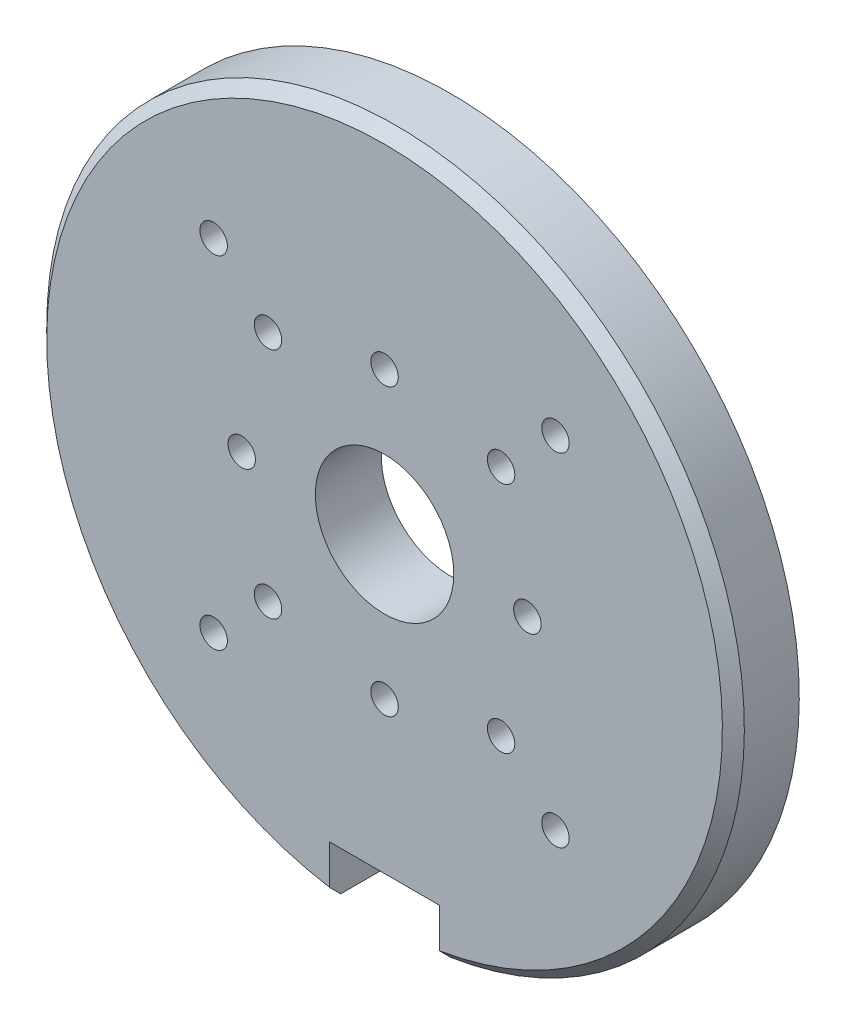
ISO-10303-21;
HEADER;
FILE_DESCRIPTION(('STEP AP214'),'2;1');
FILE_NAME('part.step','',(''),(''),'','','');
FILE_SCHEMA(('AUTOMOTIVE_DESIGN { 1 0 10303 214 1 1 1 1 }'));
ENDSEC;
DATA;
#1=APPLICATION_CONTEXT('core data for automotive mechanical design processes');
#2=APPLICATION_PROTOCOL_DEFINITION('international standard','automotive_design',2000,#1);
#3=PRODUCT_CONTEXT('',#1,'mechanical');
#4=PRODUCT('Part','Part','',(#3));
#5=PRODUCT_RELATED_PRODUCT_CATEGORY('part','',(#4));
#6=PRODUCT_DEFINITION_FORMATION('','',#4);
#7=PRODUCT_DEFINITION_CONTEXT('part definition',#1,'design');
#8=PRODUCT_DEFINITION('design','',#6,#7);
#9=PRODUCT_DEFINITION_SHAPE('','',#8);
#10=(LENGTH_UNIT() NAMED_UNIT(*) SI_UNIT(.MILLI.,.METRE.));
#11=(NAMED_UNIT(*) PLANE_ANGLE_UNIT() SI_UNIT($,.RADIAN.));
#12=(NAMED_UNIT(*) SI_UNIT($,.STERADIAN.) SOLID_ANGLE_UNIT());
#13=UNCERTAINTY_MEASURE_WITH_UNIT(LENGTH_MEASURE(1.E-05),#10,'distance_accuracy_value','');
#14=(GEOMETRIC_REPRESENTATION_CONTEXT(3) GLOBAL_UNCERTAINTY_ASSIGNED_CONTEXT((#13)) GLOBAL_UNIT_ASSIGNED_CONTEXT((#10,
#11,#12)) REPRESENTATION_CONTEXT('',''));
#15=CARTESIAN_POINT('',(0.,0.,0.));
#16=DIRECTION('',(0.,0.,1.));
#17=DIRECTION('',(1.,0.,0.));
#18=AXIS2_PLACEMENT_3D('',#15,#16,#17);
#19=CARTESIAN_POINT('',(0.,0.,6.));
#20=DIRECTION('',(0.,0.,-1.));
#21=DIRECTION('',(-1.,0.,0.));
#22=AXIS2_PLACEMENT_3D('',#19,#20,#21);
#23=CYLINDRICAL_SURFACE('',#22,31.75);
#24=DIRECTION('',(0.,0.,-1.));
#25=VECTOR('',#24,1.);
#26=CARTESIAN_POINT('',(-5.,-31.3538275175456,6.));
#27=LINE('',#26,#25);
#28=CARTESIAN_POINT('',(-5.,-31.3538275175456,0.));
#29=VERTEX_POINT('',#28);
#30=CARTESIAN_POINT('',(-5.,-31.3538275175456,5.00000000000001));
#31=VERTEX_POINT('',#30);
#32=EDGE_CURVE('E146',#29,#31,#27,.F.);
#33=ORIENTED_EDGE('',*,*,#32,.T.);
#34=CARTESIAN_POINT('',(0.,0.,5.00000000000001));
#35=DIRECTION('',(0.,0.,1.));
#36=DIRECTION('',(1.,0.,0.));
#37=AXIS2_PLACEMENT_3D('',#34,#35,#36);
#38=CIRCLE('',#37,31.75);
#39=CARTESIAN_POINT('',(5.,-31.3538275175456,5.));
#40=VERTEX_POINT('',#39);
#41=EDGE_CURVE('E52',#31,#40,#38,.F.);
#42=ORIENTED_EDGE('',*,*,#41,.T.);
#43=DIRECTION('',(0.,0.,-1.));
#44=VECTOR('',#43,1.);
#45=CARTESIAN_POINT('',(5.,-31.3538275175456,6.));
#46=LINE('',#45,#44);
#47=CARTESIAN_POINT('',(5.,-31.3538275175456,0.));
#48=VERTEX_POINT('',#47);
#49=EDGE_CURVE('E118',#40,#48,#46,.T.);
#50=ORIENTED_EDGE('',*,*,#49,.T.);
#51=CARTESIAN_POINT('',(0.,0.,0.));
#52=DIRECTION('',(0.,0.,1.));
#53=DIRECTION('',(1.,0.,0.));
#54=AXIS2_PLACEMENT_3D('',#51,#52,#53);
#55=CIRCLE('',#54,31.75);
#56=EDGE_CURVE('E113',#48,#29,#55,.T.);
#57=ORIENTED_EDGE('',*,*,#56,.T.);
#58=EDGE_LOOP('',(#33,#42,#50,#57));
#59=FACE_BOUND('',#58,.T.);
#60=ADVANCED_FACE('F39',(#59),#23,.T.);
#61=CARTESIAN_POINT('',(0.,0.,6.));
#62=DIRECTION('',(0.,0.,1.));
#63=DIRECTION('',(1.,0.,0.));
#64=AXIS2_PLACEMENT_3D('',#61,#62,#63);
#65=PLANE('',#64);
#66=CARTESIAN_POINT('',(0.,0.,6.));
#67=DIRECTION('',(0.,0.,1.));
#68=DIRECTION('',(1.,0.,0.));
#69=AXIS2_PLACEMENT_3D('',#66,#67,#68);
#70=CIRCLE('',#69,6.3);
#71=CARTESIAN_POINT('',(6.3,0.,6.));
#72=VERTEX_POINT('',#71);
#73=EDGE_CURVE('E233',#72,#72,#70,.T.);
#74=ORIENTED_EDGE('',*,*,#73,.F.);
#75=EDGE_LOOP('',(#74));
#76=FACE_BOUND('',#75,.T.);
#77=CARTESIAN_POINT('',(-15.5563491861041,15.556349186104,6.));
#78=DIRECTION('',(0.,0.,1.));
#79=DIRECTION('',(1.,0.,0.));
#80=AXIS2_PLACEMENT_3D('',#77,#78,#79);
#81=CIRCLE('',#80,1.24999999999999);
#82=CARTESIAN_POINT('',(-14.3063491861041,15.556349186104,6.));
#83=VERTEX_POINT('',#82);
#84=EDGE_CURVE('E229',#83,#83,#81,.T.);
#85=ORIENTED_EDGE('',*,*,#84,.F.);
#86=EDGE_LOOP('',(#85));
#87=FACE_BOUND('',#86,.T.);
#88=CARTESIAN_POINT('',(-15.556349186104,-15.5563491861041,6.));
#89=DIRECTION('',(0.,0.,1.));
#90=DIRECTION('',(1.,0.,0.));
#91=AXIS2_PLACEMENT_3D('',#88,#89,#90);
#92=CIRCLE('',#91,1.24999999999999);
#93=CARTESIAN_POINT('',(-14.306349186104,-15.5563491861041,6.));
#94=VERTEX_POINT('',#93);
#95=EDGE_CURVE('E223',#94,#94,#92,.T.);
#96=ORIENTED_EDGE('',*,*,#95,.F.);
#97=EDGE_LOOP('',(#96));
#98=FACE_BOUND('',#97,.T.);
#99=CARTESIAN_POINT('',(15.556349186104,-15.5563491861041,6.));
#100=DIRECTION('',(0.,0.,1.));
#101=DIRECTION('',(1.,0.,0.));
#102=AXIS2_PLACEMENT_3D('',#99,#100,#101);
#103=CIRCLE('',#102,1.24999999999999);
#104=CARTESIAN_POINT('',(16.806349186104,-15.5563491861041,6.));
#105=VERTEX_POINT('',#104);
#106=EDGE_CURVE('E217',#105,#105,#103,.T.);
#107=ORIENTED_EDGE('',*,*,#106,.F.);
#108=EDGE_LOOP('',(#107));
#109=FACE_BOUND('',#108,.T.);
#110=CARTESIAN_POINT('',(15.5563491861041,15.556349186104,6.));
#111=DIRECTION('',(0.,0.,1.));
#112=DIRECTION('',(1.,0.,0.));
#113=AXIS2_PLACEMENT_3D('',#110,#111,#112);
#114=CIRCLE('',#113,1.24999999999999);
#115=CARTESIAN_POINT('',(16.806349186104,15.556349186104,6.));
#116=VERTEX_POINT('',#115);
#117=EDGE_CURVE('E211',#116,#116,#114,.T.);
#118=ORIENTED_EDGE('',*,*,#117,.F.);
#119=EDGE_LOOP('',(#118));
#120=FACE_BOUND('',#119,.T.);
#121=CARTESIAN_POINT('',(10.6066017177982,10.6066017177982,6.));
#122=DIRECTION('',(0.,0.,1.));
#123=DIRECTION('',(1.,0.,0.));
#124=AXIS2_PLACEMENT_3D('',#121,#122,#123);
#125=CIRCLE('',#124,1.24999999999999);
#126=CARTESIAN_POINT('',(11.8566017177982,10.6066017177982,6.));
#127=VERTEX_POINT('',#126);
#128=EDGE_CURVE('E205',#127,#127,#125,.T.);
#129=ORIENTED_EDGE('',*,*,#128,.F.);
#130=EDGE_LOOP('',(#129));
#131=FACE_BOUND('',#130,.T.);
#132=CARTESIAN_POINT('',(-10.6066017177982,10.6066017177982,6.));
#133=DIRECTION('',(0.,0.,1.));
#134=DIRECTION('',(1.,0.,0.));
#135=AXIS2_PLACEMENT_3D('',#132,#133,#134);
#136=CIRCLE('',#135,1.24999999999999);
#137=CARTESIAN_POINT('',(-9.35660171779824,10.6066017177982,6.));
#138=VERTEX_POINT('',#137);
#139=EDGE_CURVE('E199',#138,#138,#136,.T.);
#140=ORIENTED_EDGE('',*,*,#139,.F.);
#141=EDGE_LOOP('',(#140));
#142=FACE_BOUND('',#141,.T.);
#143=CARTESIAN_POINT('',(-10.6066017177982,-10.6066017177982,6.));
#144=DIRECTION('',(0.,0.,1.));
#145=DIRECTION('',(1.,0.,0.));
#146=AXIS2_PLACEMENT_3D('',#143,#144,#145);
#147=CIRCLE('',#146,1.24999999999999);
#148=CARTESIAN_POINT('',(-9.35660171779821,-10.6066017177982,6.));
#149=VERTEX_POINT('',#148);
#150=EDGE_CURVE('E193',#149,#149,#147,.T.);
#151=ORIENTED_EDGE('',*,*,#150,.F.);
#152=EDGE_LOOP('',(#151));
#153=FACE_BOUND('',#152,.T.);
#154=CARTESIAN_POINT('',(10.6066017177982,-10.6066017177983,6.));
#155=DIRECTION('',(0.,0.,1.));
#156=DIRECTION('',(1.,0.,0.));
#157=AXIS2_PLACEMENT_3D('',#154,#155,#156);
#158=CIRCLE('',#157,1.24999999999999);
#159=CARTESIAN_POINT('',(11.8566017177982,-10.6066017177983,6.));
#160=VERTEX_POINT('',#159);
#161=EDGE_CURVE('E187',#160,#160,#158,.T.);
#162=ORIENTED_EDGE('',*,*,#161,.F.);
#163=EDGE_LOOP('',(#162));
#164=FACE_BOUND('',#163,.T.);
#165=CARTESIAN_POINT('',(0.,13.,6.));
#166=DIRECTION('',(0.,0.,1.));
#167=DIRECTION('',(1.,0.,0.));
#168=AXIS2_PLACEMENT_3D('',#165,#166,#167);
#169=CIRCLE('',#168,1.25);
#170=CARTESIAN_POINT('',(1.25,13.,6.));
#171=VERTEX_POINT('',#170);
#172=EDGE_CURVE('E181',#171,#171,#169,.T.);
#173=ORIENTED_EDGE('',*,*,#172,.F.);
#174=EDGE_LOOP('',(#173));
#175=FACE_BOUND('',#174,.T.);
#176=CARTESIAN_POINT('',(13.,0.,6.));
#177=DIRECTION('',(0.,0.,1.));
#178=DIRECTION('',(1.,0.,0.));
#179=AXIS2_PLACEMENT_3D('',#176,#177,#178);
#180=CIRCLE('',#179,1.25);
#181=CARTESIAN_POINT('',(14.25,0.,6.));
#182=VERTEX_POINT('',#181);
#183=EDGE_CURVE('E175',#182,#182,#180,.T.);
#184=ORIENTED_EDGE('',*,*,#183,.F.);
#185=EDGE_LOOP('',(#184));
#186=FACE_BOUND('',#185,.T.);
#187=CARTESIAN_POINT('',(-13.,0.,6.));
#188=DIRECTION('',(0.,0.,1.));
#189=DIRECTION('',(1.,0.,0.));
#190=AXIS2_PLACEMENT_3D('',#187,#188,#189);
#191=CIRCLE('',#190,1.25);
#192=CARTESIAN_POINT('',(-11.75,0.,6.));
#193=VERTEX_POINT('',#192);
#194=EDGE_CURVE('E169',#193,#193,#191,.T.);
#195=ORIENTED_EDGE('',*,*,#194,.F.);
#196=EDGE_LOOP('',(#195));
#197=FACE_BOUND('',#196,.T.);
#198=CARTESIAN_POINT('',(0.,-13.,6.));
#199=DIRECTION('',(0.,0.,1.));
#200=DIRECTION('',(1.,0.,0.));
#201=AXIS2_PLACEMENT_3D('',#198,#199,#200);
#202=CIRCLE('',#201,1.25);
#203=CARTESIAN_POINT('',(1.25,-13.,6.));
#204=VERTEX_POINT('',#203);
#205=EDGE_CURVE('E158',#204,#204,#202,.T.);
#206=ORIENTED_EDGE('',*,*,#205,.F.);
#207=EDGE_LOOP('',(#206));
#208=FACE_BOUND('',#207,.T.);
#209=DIRECTION('',(0.,1.,0.));
#210=VECTOR('',#209,1.);
#211=CARTESIAN_POINT('',(5.,-26.75,6.));
#212=LINE('',#211,#210);
#213=CARTESIAN_POINT('',(5.,-30.3407728972088,6.));
#214=VERTEX_POINT('',#213);
#215=CARTESIAN_POINT('',(5.,-26.75,6.));
#216=VERTEX_POINT('',#215);
#217=EDGE_CURVE('E96',#214,#216,#212,.T.);
#218=ORIENTED_EDGE('',*,*,#217,.F.);
#219=CARTESIAN_POINT('',(0.,0.,6.));
#220=DIRECTION('',(0.,0.,1.));
#221=DIRECTION('',(1.,0.,0.));
#222=AXIS2_PLACEMENT_3D('',#219,#220,#221);
#223=CIRCLE('',#222,30.75);
#224=CARTESIAN_POINT('',(-5.,-30.3407728972088,6.));
#225=VERTEX_POINT('',#224);
#226=EDGE_CURVE('E114',#214,#225,#223,.T.);
#227=ORIENTED_EDGE('',*,*,#226,.T.);
#228=DIRECTION('',(0.,-1.,0.));
#229=VECTOR('',#228,1.);
#230=CARTESIAN_POINT('',(-5.,-26.75,6.));
#231=LINE('',#230,#229);
#232=CARTESIAN_POINT('',(-5.,-26.75,6.));
#233=VERTEX_POINT('',#232);
#234=EDGE_CURVE('E109',#233,#225,#231,.T.);
#235=ORIENTED_EDGE('',*,*,#234,.F.);
#236=DIRECTION('',(-1.,0.,0.));
#237=VECTOR('',#236,1.);
#238=CARTESIAN_POINT('',(-5.,-26.75,6.));
#239=LINE('',#238,#237);
#240=EDGE_CURVE('E153',#216,#233,#239,.T.);
#241=ORIENTED_EDGE('',*,*,#240,.F.);
#242=EDGE_LOOP('',(#218,#227,#235,#241));
#243=FACE_BOUND('',#242,.T.);
#244=ADVANCED_FACE('F137',(#76,#87,#98,#109,#120,#131,#142,#153,#164,#175,#186,#197,#208,#243),
#65,.T.);
#245=CARTESIAN_POINT('',(0.,0.,0.));
#246=DIRECTION('',(0.,0.,1.));
#247=DIRECTION('',(1.,0.,0.));
#248=AXIS2_PLACEMENT_3D('',#245,#246,#247);
#249=PLANE('',#248);
#250=CARTESIAN_POINT('',(0.,0.,0.));
#251=DIRECTION('',(0.,0.,1.));
#252=DIRECTION('',(1.,0.,0.));
#253=AXIS2_PLACEMENT_3D('',#250,#251,#252);
#254=CIRCLE('',#253,6.3);
#255=CARTESIAN_POINT('',(6.3,0.,0.));
#256=VERTEX_POINT('',#255);
#257=EDGE_CURVE('E232',#256,#256,#254,.T.);
#258=ORIENTED_EDGE('',*,*,#257,.T.);
#259=EDGE_LOOP('',(#258));
#260=FACE_BOUND('',#259,.T.);
#261=CARTESIAN_POINT('',(-15.5563491861041,15.556349186104,0.));
#262=DIRECTION('',(0.,0.,1.));
#263=DIRECTION('',(1.,0.,0.));
#264=AXIS2_PLACEMENT_3D('',#261,#262,#263);
#265=CIRCLE('',#264,1.25);
#266=CARTESIAN_POINT('',(-14.3063491861041,15.556349186104,0.));
#267=VERTEX_POINT('',#266);
#268=EDGE_CURVE('E226',#267,#267,#265,.T.);
#269=ORIENTED_EDGE('',*,*,#268,.T.);
#270=EDGE_LOOP('',(#269));
#271=FACE_BOUND('',#270,.T.);
#272=CARTESIAN_POINT('',(-15.556349186104,-15.5563491861041,0.));
#273=DIRECTION('',(0.,0.,1.));
#274=DIRECTION('',(1.,0.,0.));
#275=AXIS2_PLACEMENT_3D('',#272,#273,#274);
#276=CIRCLE('',#275,1.25);
#277=CARTESIAN_POINT('',(-14.306349186104,-15.5563491861041,0.));
#278=VERTEX_POINT('',#277);
#279=EDGE_CURVE('E220',#278,#278,#276,.T.);
#280=ORIENTED_EDGE('',*,*,#279,.T.);
#281=EDGE_LOOP('',(#280));
#282=FACE_BOUND('',#281,.T.);
#283=CARTESIAN_POINT('',(15.556349186104,-15.5563491861041,0.));
#284=DIRECTION('',(0.,0.,1.));
#285=DIRECTION('',(1.,0.,0.));
#286=AXIS2_PLACEMENT_3D('',#283,#284,#285);
#287=CIRCLE('',#286,1.25);
#288=CARTESIAN_POINT('',(16.806349186104,-15.5563491861041,0.));
#289=VERTEX_POINT('',#288);
#290=EDGE_CURVE('E214',#289,#289,#287,.T.);
#291=ORIENTED_EDGE('',*,*,#290,.T.);
#292=EDGE_LOOP('',(#291));
#293=FACE_BOUND('',#292,.T.);
#294=CARTESIAN_POINT('',(15.5563491861041,15.556349186104,0.));
#295=DIRECTION('',(0.,0.,1.));
#296=DIRECTION('',(1.,0.,0.));
#297=AXIS2_PLACEMENT_3D('',#294,#295,#296);
#298=CIRCLE('',#297,1.25);
#299=CARTESIAN_POINT('',(16.8063491861041,15.556349186104,0.));
#300=VERTEX_POINT('',#299);
#301=EDGE_CURVE('E208',#300,#300,#298,.T.);
#302=ORIENTED_EDGE('',*,*,#301,.T.);
#303=EDGE_LOOP('',(#302));
#304=FACE_BOUND('',#303,.T.);
#305=CARTESIAN_POINT('',(10.6066017177982,10.6066017177982,0.));
#306=DIRECTION('',(0.,0.,1.));
#307=DIRECTION('',(1.,0.,0.));
#308=AXIS2_PLACEMENT_3D('',#305,#306,#307);
#309=CIRCLE('',#308,1.25);
#310=CARTESIAN_POINT('',(11.8566017177982,10.6066017177982,0.));
#311=VERTEX_POINT('',#310);
#312=EDGE_CURVE('E202',#311,#311,#309,.T.);
#313=ORIENTED_EDGE('',*,*,#312,.T.);
#314=EDGE_LOOP('',(#313));
#315=FACE_BOUND('',#314,.T.);
#316=CARTESIAN_POINT('',(-10.6066017177982,10.6066017177982,0.));
#317=DIRECTION('',(0.,0.,1.));
#318=DIRECTION('',(1.,0.,0.));
#319=AXIS2_PLACEMENT_3D('',#316,#317,#318);
#320=CIRCLE('',#319,1.25);
#321=CARTESIAN_POINT('',(-9.35660171779823,10.6066017177982,0.));
#322=VERTEX_POINT('',#321);
#323=EDGE_CURVE('E196',#322,#322,#320,.T.);
#324=ORIENTED_EDGE('',*,*,#323,.T.);
#325=EDGE_LOOP('',(#324));
#326=FACE_BOUND('',#325,.T.);
#327=CARTESIAN_POINT('',(-10.6066017177982,-10.6066017177982,0.));
#328=DIRECTION('',(0.,0.,1.));
#329=DIRECTION('',(1.,0.,0.));
#330=AXIS2_PLACEMENT_3D('',#327,#328,#329);
#331=CIRCLE('',#330,1.25);
#332=CARTESIAN_POINT('',(-9.3566017177982,-10.6066017177982,0.));
#333=VERTEX_POINT('',#332);
#334=EDGE_CURVE('E190',#333,#333,#331,.T.);
#335=ORIENTED_EDGE('',*,*,#334,.T.);
#336=EDGE_LOOP('',(#335));
#337=FACE_BOUND('',#336,.T.);
#338=CARTESIAN_POINT('',(10.6066017177982,-10.6066017177983,0.));
#339=DIRECTION('',(0.,0.,1.));
#340=DIRECTION('',(1.,0.,0.));
#341=AXIS2_PLACEMENT_3D('',#338,#339,#340);
#342=CIRCLE('',#341,1.25);
#343=CARTESIAN_POINT('',(11.8566017177982,-10.6066017177983,0.));
#344=VERTEX_POINT('',#343);
#345=EDGE_CURVE('E184',#344,#344,#342,.T.);
#346=ORIENTED_EDGE('',*,*,#345,.T.);
#347=EDGE_LOOP('',(#346));
#348=FACE_BOUND('',#347,.T.);
#349=CARTESIAN_POINT('',(0.,13.,0.));
#350=DIRECTION('',(0.,0.,1.));
#351=DIRECTION('',(1.,0.,0.));
#352=AXIS2_PLACEMENT_3D('',#349,#350,#351);
#353=CIRCLE('',#352,1.25);
#354=CARTESIAN_POINT('',(1.25,13.,0.));
#355=VERTEX_POINT('',#354);
#356=EDGE_CURVE('E178',#355,#355,#353,.T.);
#357=ORIENTED_EDGE('',*,*,#356,.T.);
#358=EDGE_LOOP('',(#357));
#359=FACE_BOUND('',#358,.T.);
#360=CARTESIAN_POINT('',(13.,0.,0.));
#361=DIRECTION('',(0.,0.,1.));
#362=DIRECTION('',(1.,0.,0.));
#363=AXIS2_PLACEMENT_3D('',#360,#361,#362);
#364=CIRCLE('',#363,1.25);
#365=CARTESIAN_POINT('',(14.25,0.,0.));
#366=VERTEX_POINT('',#365);
#367=EDGE_CURVE('E172',#366,#366,#364,.T.);
#368=ORIENTED_EDGE('',*,*,#367,.T.);
#369=EDGE_LOOP('',(#368));
#370=FACE_BOUND('',#369,.T.);
#371=CARTESIAN_POINT('',(-13.,0.,0.));
#372=DIRECTION('',(0.,0.,1.));
#373=DIRECTION('',(1.,0.,0.));
#374=AXIS2_PLACEMENT_3D('',#371,#372,#373);
#375=CIRCLE('',#374,1.25);
#376=CARTESIAN_POINT('',(-11.75,0.,0.));
#377=VERTEX_POINT('',#376);
#378=EDGE_CURVE('E166',#377,#377,#375,.T.);
#379=ORIENTED_EDGE('',*,*,#378,.T.);
#380=EDGE_LOOP('',(#379));
#381=FACE_BOUND('',#380,.T.);
#382=CARTESIAN_POINT('',(0.,-13.,0.));
#383=DIRECTION('',(0.,0.,1.));
#384=DIRECTION('',(1.,0.,0.));
#385=AXIS2_PLACEMENT_3D('',#382,#383,#384);
#386=CIRCLE('',#385,1.25);
#387=CARTESIAN_POINT('',(1.25,-13.,0.));
#388=VERTEX_POINT('',#387);
#389=EDGE_CURVE('E154',#388,#388,#386,.T.);
#390=ORIENTED_EDGE('',*,*,#389,.T.);
#391=EDGE_LOOP('',(#390));
#392=FACE_BOUND('',#391,.T.);
#393=ORIENTED_EDGE('',*,*,#56,.F.);
#394=DIRECTION('',(0.,1.,0.));
#395=VECTOR('',#394,1.);
#396=CARTESIAN_POINT('',(4.99999999999999,0.,0.));
#397=LINE('',#396,#395);
#398=CARTESIAN_POINT('',(5.,-26.75,0.));
#399=VERTEX_POINT('',#398);
#400=EDGE_CURVE('E93',#48,#399,#397,.T.);
#401=ORIENTED_EDGE('',*,*,#400,.T.);
#402=DIRECTION('',(-1.,0.,0.));
#403=VECTOR('',#402,1.);
#404=CARTESIAN_POINT('',(-5.,-26.75,0.));
#405=LINE('',#404,#403);
#406=CARTESIAN_POINT('',(-5.,-26.75,0.));
#407=VERTEX_POINT('',#406);
#408=EDGE_CURVE('E105',#399,#407,#405,.T.);
#409=ORIENTED_EDGE('',*,*,#408,.T.);
#410=DIRECTION('',(0.,-1.,0.));
#411=VECTOR('',#410,1.);
#412=CARTESIAN_POINT('',(-5.,-26.75,0.));
#413=LINE('',#412,#411);
#414=EDGE_CURVE('E101',#407,#29,#413,.T.);
#415=ORIENTED_EDGE('',*,*,#414,.T.);
#416=EDGE_LOOP('',(#393,#401,#409,#415));
#417=FACE_BOUND('',#416,.T.);
#418=ADVANCED_FACE('F111',(#260,#271,#282,#293,#304,#315,#326,#337,#348,#359,#370,#381,#392,
#417),#249,.F.);
#419=CARTESIAN_POINT('',(5.,-26.75,0.));
#420=DIRECTION('',(1.,0.,0.));
#421=DIRECTION('',(0.,1.,0.));
#422=AXIS2_PLACEMENT_3D('',#419,#420,#421);
#423=PLANE('',#422);
#424=ORIENTED_EDGE('',*,*,#49,.F.);
#425=CARTESIAN_POINT('',(5.,-31.3538275175456,5.00000000000001));
#426=CARTESIAN_POINT('',(5.,-31.1850201174581,5.16670216063221));
#427=CARTESIAN_POINT('',(5.,-31.0161951990678,5.33338657426692));
#428=CARTESIAN_POINT('',(5.,-30.6785103256222,5.66671990760026));
#429=CARTESIAN_POINT('',(5.,-30.5096503705669,5.83336882729889));
#430=CARTESIAN_POINT('',(5.,-30.3407728972088,6.));
#431=B_SPLINE_CURVE_WITH_KNOTS('',3,(#425,#426,#427,#428,#429,#430),.UNSPECIFIED.,.F.,.F.,(4,2,
4),(0.,0.711737255849346,1.42347451195032),.UNSPECIFIED.);
#432=EDGE_CURVE('E11',#40,#214,#431,.T.);
#433=ORIENTED_EDGE('',*,*,#432,.T.);
#434=ORIENTED_EDGE('',*,*,#217,.T.);
#435=DIRECTION('',(0.,0.,1.));
#436=VECTOR('',#435,1.);
#437=CARTESIAN_POINT('',(5.,-26.75,0.));
#438=LINE('',#437,#436);
#439=EDGE_CURVE('E89',#399,#216,#438,.T.);
#440=ORIENTED_EDGE('',*,*,#439,.F.);
#441=ORIENTED_EDGE('',*,*,#400,.F.);
#442=EDGE_LOOP('',(#424,#433,#434,#440,#441));
#443=FACE_BOUND('',#442,.T.);
#444=ADVANCED_FACE('F91',(#443),#423,.F.);
#445=CARTESIAN_POINT('',(-5.,-26.75,0.));
#446=DIRECTION('',(-1.,0.,0.));
#447=DIRECTION('',(0.,-1.,0.));
#448=AXIS2_PLACEMENT_3D('',#445,#446,#447);
#449=PLANE('',#448);
#450=ORIENTED_EDGE('',*,*,#234,.T.);
#451=CARTESIAN_POINT('',(-5.,-30.3407728972088,6.));
#452=CARTESIAN_POINT('',(-5.,-30.5096503705669,5.83336882729889));
#453=CARTESIAN_POINT('',(-5.,-30.6785103256222,5.66671990760027));
#454=CARTESIAN_POINT('',(-5.,-31.0161951990678,5.33338657426692));
#455=CARTESIAN_POINT('',(-5.,-31.1850201174581,5.16670216063222));
#456=CARTESIAN_POINT('',(-5.,-31.3538275175456,5.00000000000001));
#457=B_SPLINE_CURVE_WITH_KNOTS('',3,(#451,#452,#453,#454,#455,#456),.UNSPECIFIED.,.F.,.F.,(4,2,
4),(0.,0.71173725610097,1.42347451195031),.UNSPECIFIED.);
#458=EDGE_CURVE('E66',#225,#31,#457,.T.);
#459=ORIENTED_EDGE('',*,*,#458,.T.);
#460=ORIENTED_EDGE('',*,*,#32,.F.);
#461=ORIENTED_EDGE('',*,*,#414,.F.);
#462=DIRECTION('',(0.,0.,1.));
#463=VECTOR('',#462,1.);
#464=CARTESIAN_POINT('',(-5.,-26.75,0.));
#465=LINE('',#464,#463);
#466=EDGE_CURVE('E100',#407,#233,#465,.T.);
#467=ORIENTED_EDGE('',*,*,#466,.T.);
#468=EDGE_LOOP('',(#450,#459,#460,#461,#467));
#469=FACE_BOUND('',#468,.T.);
#470=ADVANCED_FACE('F126',(#469),#449,.F.);
#471=CARTESIAN_POINT('',(-5.,-26.75,0.));
#472=DIRECTION('',(0.,1.,0.));
#473=DIRECTION('',(0.,0.,1.));
#474=AXIS2_PLACEMENT_3D('',#471,#472,#473);
#475=PLANE('',#474);
#476=ORIENTED_EDGE('',*,*,#240,.T.);
#477=ORIENTED_EDGE('',*,*,#466,.F.);
#478=ORIENTED_EDGE('',*,*,#408,.F.);
#479=ORIENTED_EDGE('',*,*,#439,.T.);
#480=EDGE_LOOP('',(#476,#477,#478,#479));
#481=FACE_BOUND('',#480,.T.);
#482=ADVANCED_FACE('F106',(#481),#475,.F.);
#483=CARTESIAN_POINT('',(0.,-13.,6.));
#484=DIRECTION('',(0.,0.,1.));
#485=DIRECTION('',(1.,0.,0.));
#486=AXIS2_PLACEMENT_3D('',#483,#484,#485);
#487=CYLINDRICAL_SURFACE('',#486,1.25);
#488=ORIENTED_EDGE('',*,*,#389,.F.);
#489=EDGE_LOOP('',(#488));
#490=FACE_BOUND('',#489,.T.);
#491=ORIENTED_EDGE('',*,*,#205,.T.);
#492=EDGE_LOOP('',(#491));
#493=FACE_BOUND('',#492,.T.);
#494=ADVANCED_FACE('F131',(#490,#493),#487,.F.);
#495=CARTESIAN_POINT('',(-13.,0.,6.));
#496=DIRECTION('',(0.,0.,1.));
#497=DIRECTION('',(1.,0.,0.));
#498=AXIS2_PLACEMENT_3D('',#495,#496,#497);
#499=CYLINDRICAL_SURFACE('',#498,1.25);
#500=ORIENTED_EDGE('',*,*,#378,.F.);
#501=EDGE_LOOP('',(#500));
#502=FACE_BOUND('',#501,.T.);
#503=ORIENTED_EDGE('',*,*,#194,.T.);
#504=EDGE_LOOP('',(#503));
#505=FACE_BOUND('',#504,.T.);
#506=ADVANCED_FACE('F272',(#502,#505),#499,.F.);
#507=CARTESIAN_POINT('',(13.,0.,6.));
#508=DIRECTION('',(0.,0.,1.));
#509=DIRECTION('',(1.,0.,0.));
#510=AXIS2_PLACEMENT_3D('',#507,#508,#509);
#511=CYLINDRICAL_SURFACE('',#510,1.25);
#512=ORIENTED_EDGE('',*,*,#367,.F.);
#513=EDGE_LOOP('',(#512));
#514=FACE_BOUND('',#513,.T.);
#515=ORIENTED_EDGE('',*,*,#183,.T.);
#516=EDGE_LOOP('',(#515));
#517=FACE_BOUND('',#516,.T.);
#518=ADVANCED_FACE('F277',(#514,#517),#511,.F.);
#519=CARTESIAN_POINT('',(0.,13.,6.));
#520=DIRECTION('',(0.,0.,1.));
#521=DIRECTION('',(1.,0.,0.));
#522=AXIS2_PLACEMENT_3D('',#519,#520,#521);
#523=CYLINDRICAL_SURFACE('',#522,1.25);
#524=ORIENTED_EDGE('',*,*,#356,.F.);
#525=EDGE_LOOP('',(#524));
#526=FACE_BOUND('',#525,.T.);
#527=ORIENTED_EDGE('',*,*,#172,.T.);
#528=EDGE_LOOP('',(#527));
#529=FACE_BOUND('',#528,.T.);
#530=ADVANCED_FACE('F284',(#526,#529),#523,.F.);
#531=CARTESIAN_POINT('',(10.6066017177982,-10.6066017177983,6.));
#532=DIRECTION('',(0.,0.,1.));
#533=DIRECTION('',(1.,0.,0.));
#534=AXIS2_PLACEMENT_3D('',#531,#532,#533);
#535=CYLINDRICAL_SURFACE('',#534,1.24999999999999);
#536=ORIENTED_EDGE('',*,*,#345,.F.);
#537=EDGE_LOOP('',(#536));
#538=FACE_BOUND('',#537,.T.);
#539=ORIENTED_EDGE('',*,*,#161,.T.);
#540=EDGE_LOOP('',(#539));
#541=FACE_BOUND('',#540,.T.);
#542=ADVANCED_FACE('F292',(#538,#541),#535,.F.);
#543=CARTESIAN_POINT('',(-10.6066017177982,-10.6066017177982,6.));
#544=DIRECTION('',(0.,0.,1.));
#545=DIRECTION('',(1.,0.,0.));
#546=AXIS2_PLACEMENT_3D('',#543,#544,#545);
#547=CYLINDRICAL_SURFACE('',#546,1.24999999999999);
#548=ORIENTED_EDGE('',*,*,#334,.F.);
#549=EDGE_LOOP('',(#548));
#550=FACE_BOUND('',#549,.T.);
#551=ORIENTED_EDGE('',*,*,#150,.T.);
#552=EDGE_LOOP('',(#551));
#553=FACE_BOUND('',#552,.T.);
#554=ADVANCED_FACE('F296',(#550,#553),#547,.F.);
#555=CARTESIAN_POINT('',(-10.6066017177982,10.6066017177982,6.));
#556=DIRECTION('',(0.,0.,1.));
#557=DIRECTION('',(1.,0.,0.));
#558=AXIS2_PLACEMENT_3D('',#555,#556,#557);
#559=CYLINDRICAL_SURFACE('',#558,1.24999999999999);
#560=ORIENTED_EDGE('',*,*,#323,.F.);
#561=EDGE_LOOP('',(#560));
#562=FACE_BOUND('',#561,.T.);
#563=ORIENTED_EDGE('',*,*,#139,.T.);
#564=EDGE_LOOP('',(#563));
#565=FACE_BOUND('',#564,.T.);
#566=ADVANCED_FACE('F300',(#562,#565),#559,.F.);
#567=CARTESIAN_POINT('',(10.6066017177982,10.6066017177982,6.));
#568=DIRECTION('',(0.,0.,1.));
#569=DIRECTION('',(1.,0.,0.));
#570=AXIS2_PLACEMENT_3D('',#567,#568,#569);
#571=CYLINDRICAL_SURFACE('',#570,1.24999999999999);
#572=ORIENTED_EDGE('',*,*,#312,.F.);
#573=EDGE_LOOP('',(#572));
#574=FACE_BOUND('',#573,.T.);
#575=ORIENTED_EDGE('',*,*,#128,.T.);
#576=EDGE_LOOP('',(#575));
#577=FACE_BOUND('',#576,.T.);
#578=ADVANCED_FACE('F304',(#574,#577),#571,.F.);
#579=CARTESIAN_POINT('',(15.5563491861041,15.556349186104,6.));
#580=DIRECTION('',(0.,0.,1.));
#581=DIRECTION('',(1.,0.,0.));
#582=AXIS2_PLACEMENT_3D('',#579,#580,#581);
#583=CYLINDRICAL_SURFACE('',#582,1.24999999999999);
#584=ORIENTED_EDGE('',*,*,#301,.F.);
#585=EDGE_LOOP('',(#584));
#586=FACE_BOUND('',#585,.T.);
#587=ORIENTED_EDGE('',*,*,#117,.T.);
#588=EDGE_LOOP('',(#587));
#589=FACE_BOUND('',#588,.T.);
#590=ADVANCED_FACE('F308',(#586,#589),#583,.F.);
#591=CARTESIAN_POINT('',(15.556349186104,-15.5563491861041,6.));
#592=DIRECTION('',(0.,0.,1.));
#593=DIRECTION('',(1.,0.,0.));
#594=AXIS2_PLACEMENT_3D('',#591,#592,#593);
#595=CYLINDRICAL_SURFACE('',#594,1.24999999999999);
#596=ORIENTED_EDGE('',*,*,#290,.F.);
#597=EDGE_LOOP('',(#596));
#598=FACE_BOUND('',#597,.T.);
#599=ORIENTED_EDGE('',*,*,#106,.T.);
#600=EDGE_LOOP('',(#599));
#601=FACE_BOUND('',#600,.T.);
#602=ADVANCED_FACE('F312',(#598,#601),#595,.F.);
#603=CARTESIAN_POINT('',(-15.556349186104,-15.5563491861041,6.));
#604=DIRECTION('',(0.,0.,1.));
#605=DIRECTION('',(1.,0.,0.));
#606=AXIS2_PLACEMENT_3D('',#603,#604,#605);
#607=CYLINDRICAL_SURFACE('',#606,1.24999999999999);
#608=ORIENTED_EDGE('',*,*,#279,.F.);
#609=EDGE_LOOP('',(#608));
#610=FACE_BOUND('',#609,.T.);
#611=ORIENTED_EDGE('',*,*,#95,.T.);
#612=EDGE_LOOP('',(#611));
#613=FACE_BOUND('',#612,.T.);
#614=ADVANCED_FACE('F316',(#610,#613),#607,.F.);
#615=CARTESIAN_POINT('',(-15.5563491861041,15.556349186104,6.));
#616=DIRECTION('',(0.,0.,1.));
#617=DIRECTION('',(1.,0.,0.));
#618=AXIS2_PLACEMENT_3D('',#615,#616,#617);
#619=CYLINDRICAL_SURFACE('',#618,1.24999999999999);
#620=ORIENTED_EDGE('',*,*,#268,.F.);
#621=EDGE_LOOP('',(#620));
#622=FACE_BOUND('',#621,.T.);
#623=ORIENTED_EDGE('',*,*,#84,.T.);
#624=EDGE_LOOP('',(#623));
#625=FACE_BOUND('',#624,.T.);
#626=ADVANCED_FACE('F243',(#622,#625),#619,.F.);
#627=CARTESIAN_POINT('',(0.,0.,0.));
#628=DIRECTION('',(0.,0.,1.));
#629=DIRECTION('',(1.,0.,0.));
#630=AXIS2_PLACEMENT_3D('',#627,#628,#629);
#631=CYLINDRICAL_SURFACE('',#630,6.3);
#632=ORIENTED_EDGE('',*,*,#257,.F.);
#633=EDGE_LOOP('',(#632));
#634=FACE_BOUND('',#633,.T.);
#635=ORIENTED_EDGE('',*,*,#73,.T.);
#636=EDGE_LOOP('',(#635));
#637=FACE_BOUND('',#636,.T.);
#638=ADVANCED_FACE('F240',(#634,#637),#631,.F.);
#639=CARTESIAN_POINT('',(0.,0.,6.));
#640=DIRECTION('',(0.,0.,-1.));
#641=DIRECTION('',(-1.,0.,0.));
#642=AXIS2_PLACEMENT_3D('',#639,#640,#641);
#643=CONICAL_SURFACE('',#642,30.75,0.785398163397445);
#644=ORIENTED_EDGE('',*,*,#432,.F.);
#645=ORIENTED_EDGE('',*,*,#41,.F.);
#646=ORIENTED_EDGE('',*,*,#458,.F.);
#647=ORIENTED_EDGE('',*,*,#226,.F.);
#648=EDGE_LOOP('',(#644,#645,#646,#647));
#649=FACE_BOUND('',#648,.T.);
#650=ADVANCED_FACE('F41',(#649),#643,.T.);
#651=CLOSED_SHELL('',(#60,#244,#418,#444,#470,#482,#494,#506,#518,#530,#542,#554,#566,#578,#590,
#602,#614,#626,#638,#650));
#652=MANIFOLD_SOLID_BREP('B2',#651);
#653=ADVANCED_BREP_SHAPE_REPRESENTATION('',(#18,#652),#14);
#654=SHAPE_DEFINITION_REPRESENTATION(#9,#653);
ENDSEC;
END-ISO-10303-21;
